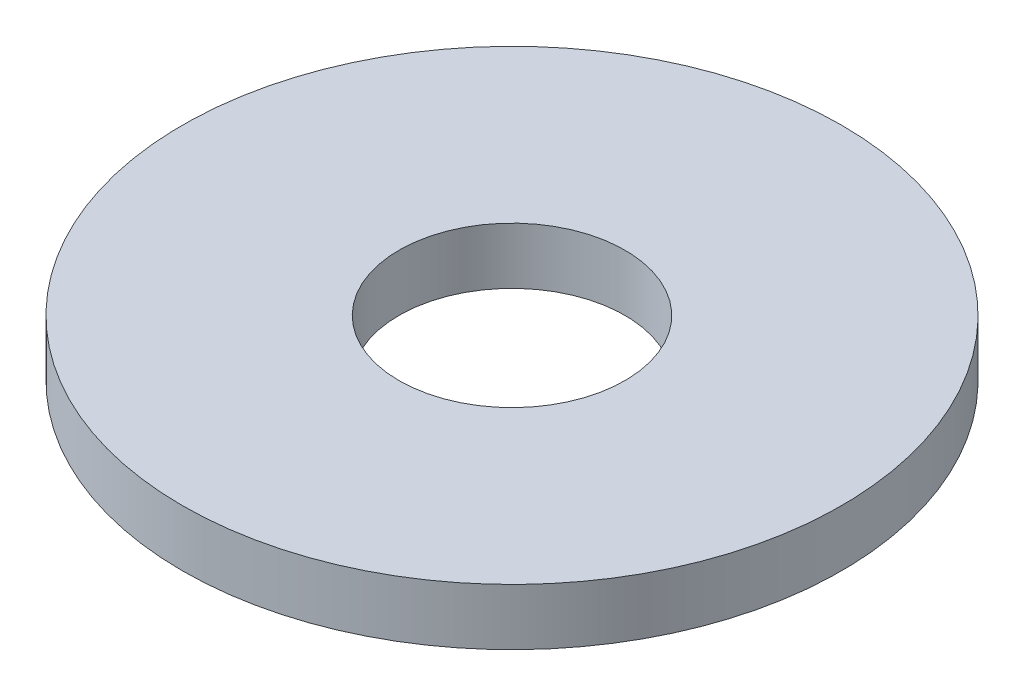
ISO-10303-21;
HEADER;
FILE_DESCRIPTION(('STEP AP214'),'2;1');
FILE_NAME('part.step','',(''),(''),'','','');
FILE_SCHEMA(('AUTOMOTIVE_DESIGN { 1 0 10303 214 1 1 1 1 }'));
ENDSEC;
DATA;
#1=APPLICATION_CONTEXT('core data for automotive mechanical design processes');
#2=APPLICATION_PROTOCOL_DEFINITION('international standard','automotive_design',2000,#1);
#3=PRODUCT_CONTEXT('',#1,'mechanical');
#4=PRODUCT('Part','Part','',(#3));
#5=PRODUCT_RELATED_PRODUCT_CATEGORY('part','',(#4));
#6=PRODUCT_DEFINITION_FORMATION('','',#4);
#7=PRODUCT_DEFINITION_CONTEXT('part definition',#1,'design');
#8=PRODUCT_DEFINITION('design','',#6,#7);
#9=PRODUCT_DEFINITION_SHAPE('','',#8);
#10=(LENGTH_UNIT() NAMED_UNIT(*) SI_UNIT(.MILLI.,.METRE.));
#11=(NAMED_UNIT(*) PLANE_ANGLE_UNIT() SI_UNIT($,.RADIAN.));
#12=(NAMED_UNIT(*) SI_UNIT($,.STERADIAN.) SOLID_ANGLE_UNIT());
#13=UNCERTAINTY_MEASURE_WITH_UNIT(LENGTH_MEASURE(1.E-05),#10,'distance_accuracy_value','');
#14=(GEOMETRIC_REPRESENTATION_CONTEXT(3) GLOBAL_UNCERTAINTY_ASSIGNED_CONTEXT((#13)) GLOBAL_UNIT_ASSIGNED_CONTEXT((#10,
#11,#12)) REPRESENTATION_CONTEXT('',''));
#15=CARTESIAN_POINT('',(0.,0.,0.));
#16=DIRECTION('',(0.,0.,1.));
#17=DIRECTION('',(1.,0.,0.));
#18=AXIS2_PLACEMENT_3D('',#15,#16,#17);
#19=CARTESIAN_POINT('',(0.,15.,0.));
#20=DIRECTION('',(0.,-1.,0.));
#21=DIRECTION('',(0.,0.,-1.));
#22=AXIS2_PLACEMENT_3D('',#19,#20,#21);
#23=CYLINDRICAL_SURFACE('',#22,87.5);
#24=CARTESIAN_POINT('',(0.,15.,0.));
#25=DIRECTION('',(0.,1.,0.));
#26=DIRECTION('',(0.,0.,1.));
#27=AXIS2_PLACEMENT_3D('',#24,#25,#26);
#28=CIRCLE('',#27,87.5);
#29=CARTESIAN_POINT('',(0.,15.,87.5));
#30=VERTEX_POINT('',#29);
#31=EDGE_CURVE('E10',#30,#30,#28,.T.);
#32=ORIENTED_EDGE('',*,*,#31,.F.);
#33=EDGE_LOOP('',(#32));
#34=FACE_BOUND('',#33,.T.);
#35=CARTESIAN_POINT('',(0.,0.,0.));
#36=DIRECTION('',(0.,1.,0.));
#37=DIRECTION('',(0.,0.,1.));
#38=AXIS2_PLACEMENT_3D('',#35,#36,#37);
#39=CIRCLE('',#38,87.5);
#40=CARTESIAN_POINT('',(0.,0.,87.5));
#41=VERTEX_POINT('',#40);
#42=EDGE_CURVE('E37',#41,#41,#39,.T.);
#43=ORIENTED_EDGE('',*,*,#42,.T.);
#44=EDGE_LOOP('',(#43));
#45=FACE_BOUND('',#44,.T.);
#46=ADVANCED_FACE('F40',(#34,#45),#23,.T.);
#47=CARTESIAN_POINT('',(0.,15.,0.));
#48=DIRECTION('',(0.,1.,0.));
#49=DIRECTION('',(0.,0.,1.));
#50=AXIS2_PLACEMENT_3D('',#47,#48,#49);
#51=PLANE('',#50);
#52=CARTESIAN_POINT('',(0.,15.,0.));
#53=DIRECTION('',(0.,1.,0.));
#54=DIRECTION('',(0.,0.,1.));
#55=AXIS2_PLACEMENT_3D('',#52,#53,#54);
#56=CIRCLE('',#55,30.);
#57=CARTESIAN_POINT('',(0.,15.,30.));
#58=VERTEX_POINT('',#57);
#59=EDGE_CURVE('E50',#58,#58,#56,.T.);
#60=ORIENTED_EDGE('',*,*,#59,.F.);
#61=EDGE_LOOP('',(#60));
#62=FACE_BOUND('',#61,.T.);
#63=ORIENTED_EDGE('',*,*,#31,.T.);
#64=EDGE_LOOP('',(#63));
#65=FACE_BOUND('',#64,.T.);
#66=ADVANCED_FACE('F59',(#62,#65),#51,.T.);
#67=CARTESIAN_POINT('',(0.,0.,0.));
#68=DIRECTION('',(0.,1.,0.));
#69=DIRECTION('',(0.,0.,1.));
#70=AXIS2_PLACEMENT_3D('',#67,#68,#69);
#71=PLANE('',#70);
#72=CARTESIAN_POINT('',(0.,0.,0.));
#73=DIRECTION('',(0.,1.,0.));
#74=DIRECTION('',(0.,0.,1.));
#75=AXIS2_PLACEMENT_3D('',#72,#73,#74);
#76=CIRCLE('',#75,30.);
#77=CARTESIAN_POINT('',(0.,0.,30.));
#78=VERTEX_POINT('',#77);
#79=EDGE_CURVE('E47',#78,#78,#76,.T.);
#80=ORIENTED_EDGE('',*,*,#79,.T.);
#81=EDGE_LOOP('',(#80));
#82=FACE_BOUND('',#81,.T.);
#83=ORIENTED_EDGE('',*,*,#42,.F.);
#84=EDGE_LOOP('',(#83));
#85=FACE_BOUND('',#84,.T.);
#86=ADVANCED_FACE('F58',(#82,#85),#71,.F.);
#87=CARTESIAN_POINT('',(0.,15.,0.));
#88=DIRECTION('',(0.,-1.,0.));
#89=DIRECTION('',(0.,0.,-1.));
#90=AXIS2_PLACEMENT_3D('',#87,#88,#89);
#91=CYLINDRICAL_SURFACE('',#90,30.);
#92=ORIENTED_EDGE('',*,*,#59,.T.);
#93=EDGE_LOOP('',(#92));
#94=FACE_BOUND('',#93,.T.);
#95=ORIENTED_EDGE('',*,*,#79,.F.);
#96=EDGE_LOOP('',(#95));
#97=FACE_BOUND('',#96,.T.);
#98=ADVANCED_FACE('F54',(#94,#97),#91,.F.);
#99=CLOSED_SHELL('',(#46,#66,#86,#98));
#100=MANIFOLD_SOLID_BREP('B2',#99);
#101=ADVANCED_BREP_SHAPE_REPRESENTATION('',(#18,#100),#14);
#102=SHAPE_DEFINITION_REPRESENTATION(#9,#101);
ENDSEC;
END-ISO-10303-21;
